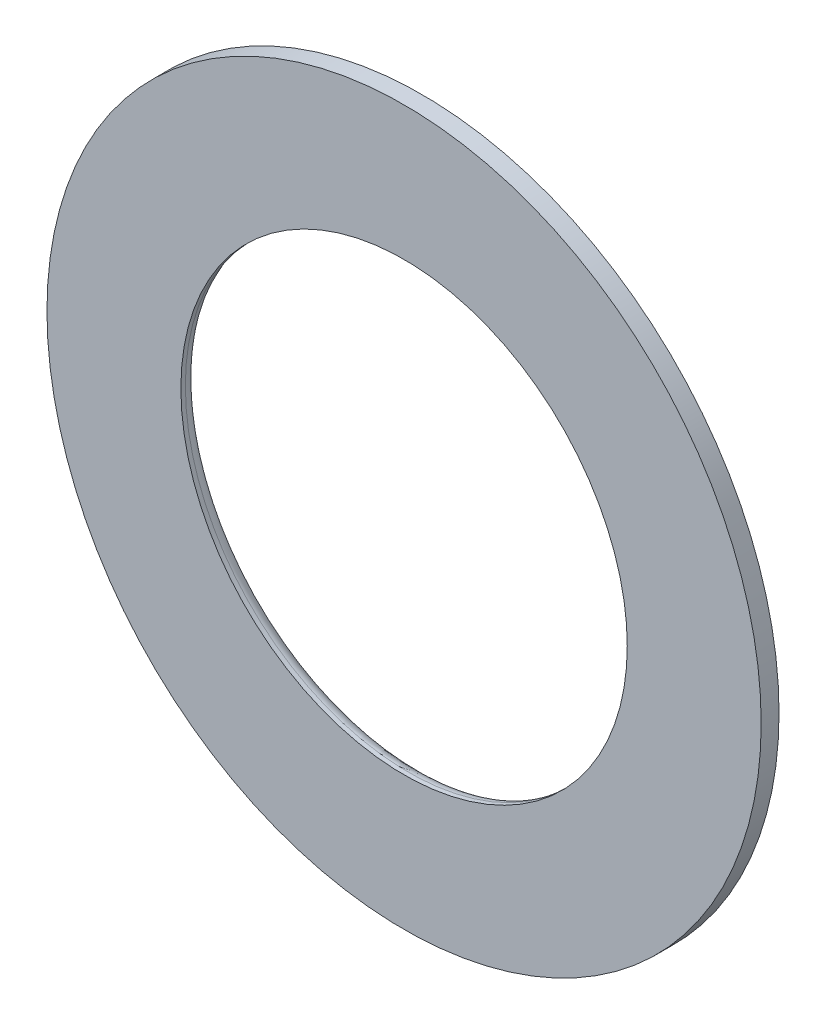
ISO-10303-21;
HEADER;
FILE_DESCRIPTION(('STEP AP214'),'2;1');
FILE_NAME('part.step','',(''),(''),'','','');
FILE_SCHEMA(('AUTOMOTIVE_DESIGN { 1 0 10303 214 1 1 1 1 }'));
ENDSEC;
DATA;
#1=APPLICATION_CONTEXT('core data for automotive mechanical design processes');
#2=APPLICATION_PROTOCOL_DEFINITION('international standard','automotive_design',2000,#1);
#3=PRODUCT_CONTEXT('',#1,'mechanical');
#4=PRODUCT('Part','Part','',(#3));
#5=PRODUCT_RELATED_PRODUCT_CATEGORY('part','',(#4));
#6=PRODUCT_DEFINITION_FORMATION('','',#4);
#7=PRODUCT_DEFINITION_CONTEXT('part definition',#1,'design');
#8=PRODUCT_DEFINITION('design','',#6,#7);
#9=PRODUCT_DEFINITION_SHAPE('','',#8);
#10=(LENGTH_UNIT() NAMED_UNIT(*) SI_UNIT(.MILLI.,.METRE.));
#11=(NAMED_UNIT(*) PLANE_ANGLE_UNIT() SI_UNIT($,.RADIAN.));
#12=(NAMED_UNIT(*) SI_UNIT($,.STERADIAN.) SOLID_ANGLE_UNIT());
#13=UNCERTAINTY_MEASURE_WITH_UNIT(LENGTH_MEASURE(1.E-05),#10,'distance_accuracy_value','');
#14=(GEOMETRIC_REPRESENTATION_CONTEXT(3) GLOBAL_UNCERTAINTY_ASSIGNED_CONTEXT((#13)) GLOBAL_UNIT_ASSIGNED_CONTEXT((#10,
#11,#12)) REPRESENTATION_CONTEXT('',''));
#15=CARTESIAN_POINT('',(0.,0.,0.));
#16=DIRECTION('',(0.,0.,1.));
#17=DIRECTION('',(1.,0.,0.));
#18=AXIS2_PLACEMENT_3D('',#15,#16,#17);
#19=CARTESIAN_POINT('',(0.,0.,2.));
#20=DIRECTION('',(0.,0.,1.));
#21=DIRECTION('',(1.,0.,0.));
#22=AXIS2_PLACEMENT_3D('',#19,#20,#21);
#23=PLANE('',#22);
#24=CARTESIAN_POINT('',(0.,0.,2.));
#25=DIRECTION('',(0.,0.,1.));
#26=DIRECTION('',(1.,0.,0.));
#27=AXIS2_PLACEMENT_3D('',#24,#25,#26);
#28=CIRCLE('',#27,40.);
#29=CARTESIAN_POINT('',(40.,0.,2.));
#30=VERTEX_POINT('',#29);
#31=EDGE_CURVE('E54',#30,#30,#28,.T.);
#32=ORIENTED_EDGE('',*,*,#31,.T.);
#33=EDGE_LOOP('',(#32));
#34=FACE_BOUND('',#33,.T.);
#35=CARTESIAN_POINT('',(0.,0.,2.));
#36=DIRECTION('',(0.,0.,1.));
#37=DIRECTION('',(1.,0.,0.));
#38=AXIS2_PLACEMENT_3D('',#35,#36,#37);
#39=CIRCLE('',#38,25.);
#40=CARTESIAN_POINT('',(25.,0.,2.));
#41=VERTEX_POINT('',#40);
#42=EDGE_CURVE('E64',#41,#41,#39,.T.);
#43=ORIENTED_EDGE('',*,*,#42,.F.);
#44=EDGE_LOOP('',(#43));
#45=FACE_BOUND('',#44,.T.);
#46=ADVANCED_FACE('F41',(#34,#45),#23,.T.);
#47=CARTESIAN_POINT('',(0.,0.,0.));
#48=DIRECTION('',(0.,0.,1.));
#49=DIRECTION('',(1.,0.,0.));
#50=AXIS2_PLACEMENT_3D('',#47,#48,#49);
#51=PLANE('',#50);
#52=CARTESIAN_POINT('',(0.,0.,0.));
#53=DIRECTION('',(0.,0.,1.));
#54=DIRECTION('',(1.,0.,0.));
#55=AXIS2_PLACEMENT_3D('',#52,#53,#54);
#56=CIRCLE('',#55,26.5);
#57=CARTESIAN_POINT('',(26.5,0.,0.));
#58=VERTEX_POINT('',#57);
#59=EDGE_CURVE('E49',#58,#58,#56,.T.);
#60=ORIENTED_EDGE('',*,*,#59,.T.);
#61=EDGE_LOOP('',(#60));
#62=FACE_BOUND('',#61,.T.);
#63=CARTESIAN_POINT('',(0.,0.,0.));
#64=DIRECTION('',(0.,0.,1.));
#65=DIRECTION('',(1.,0.,0.));
#66=AXIS2_PLACEMENT_3D('',#63,#64,#65);
#67=CIRCLE('',#66,40.);
#68=CARTESIAN_POINT('',(40.,0.,0.));
#69=VERTEX_POINT('',#68);
#70=EDGE_CURVE('E59',#69,#69,#67,.T.);
#71=ORIENTED_EDGE('',*,*,#70,.F.);
#72=EDGE_LOOP('',(#71));
#73=FACE_BOUND('',#72,.T.);
#74=ADVANCED_FACE('F73',(#62,#73),#51,.F.);
#75=CARTESIAN_POINT('',(0.,0.,2.));
#76=DIRECTION('',(0.,0.,-1.));
#77=DIRECTION('',(-1.,0.,0.));
#78=AXIS2_PLACEMENT_3D('',#75,#76,#77);
#79=CYLINDRICAL_SURFACE('',#78,40.);
#80=ORIENTED_EDGE('',*,*,#31,.F.);
#81=EDGE_LOOP('',(#80));
#82=FACE_BOUND('',#81,.T.);
#83=ORIENTED_EDGE('',*,*,#70,.T.);
#84=EDGE_LOOP('',(#83));
#85=FACE_BOUND('',#84,.T.);
#86=ADVANCED_FACE('F79',(#82,#85),#79,.T.);
#87=CARTESIAN_POINT('',(0.,0.,2.));
#88=DIRECTION('',(0.,0.,-1.));
#89=DIRECTION('',(-1.,0.,0.));
#90=AXIS2_PLACEMENT_3D('',#87,#88,#89);
#91=CYLINDRICAL_SURFACE('',#90,25.);
#92=CARTESIAN_POINT('',(0.,0.,1.5));
#93=DIRECTION('',(0.,0.,1.));
#94=DIRECTION('',(1.,0.,0.));
#95=AXIS2_PLACEMENT_3D('',#92,#93,#94);
#96=CIRCLE('',#95,25.);
#97=CARTESIAN_POINT('',(25.,0.,1.5));
#98=VERTEX_POINT('',#97);
#99=EDGE_CURVE('E10',#98,#98,#96,.F.);
#100=ORIENTED_EDGE('',*,*,#99,.T.);
#101=EDGE_LOOP('',(#100));
#102=FACE_BOUND('',#101,.T.);
#103=ORIENTED_EDGE('',*,*,#42,.T.);
#104=EDGE_LOOP('',(#103));
#105=FACE_BOUND('',#104,.T.);
#106=ADVANCED_FACE('F70',(#102,#105),#91,.F.);
#107=CARTESIAN_POINT('',(0.,0.,1.5));
#108=DIRECTION('',(0.,0.,1.));
#109=DIRECTION('',(1.,0.,0.));
#110=AXIS2_PLACEMENT_3D('',#107,#108,#109);
#111=TOROIDAL_SURFACE('',#110,26.5,1.5);
#112=ORIENTED_EDGE('',*,*,#99,.F.);
#113=EDGE_LOOP('',(#112));
#114=FACE_BOUND('',#113,.T.);
#115=ORIENTED_EDGE('',*,*,#59,.F.);
#116=EDGE_LOOP('',(#115));
#117=FACE_BOUND('',#116,.T.);
#118=ADVANCED_FACE('F43',(#114,#117),#111,.T.);
#119=CLOSED_SHELL('',(#46,#74,#86,#106,#118));
#120=MANIFOLD_SOLID_BREP('B2',#119);
#121=ADVANCED_BREP_SHAPE_REPRESENTATION('',(#18,#120),#14);
#122=SHAPE_DEFINITION_REPRESENTATION(#9,#121);
ENDSEC;
END-ISO-10303-21;
